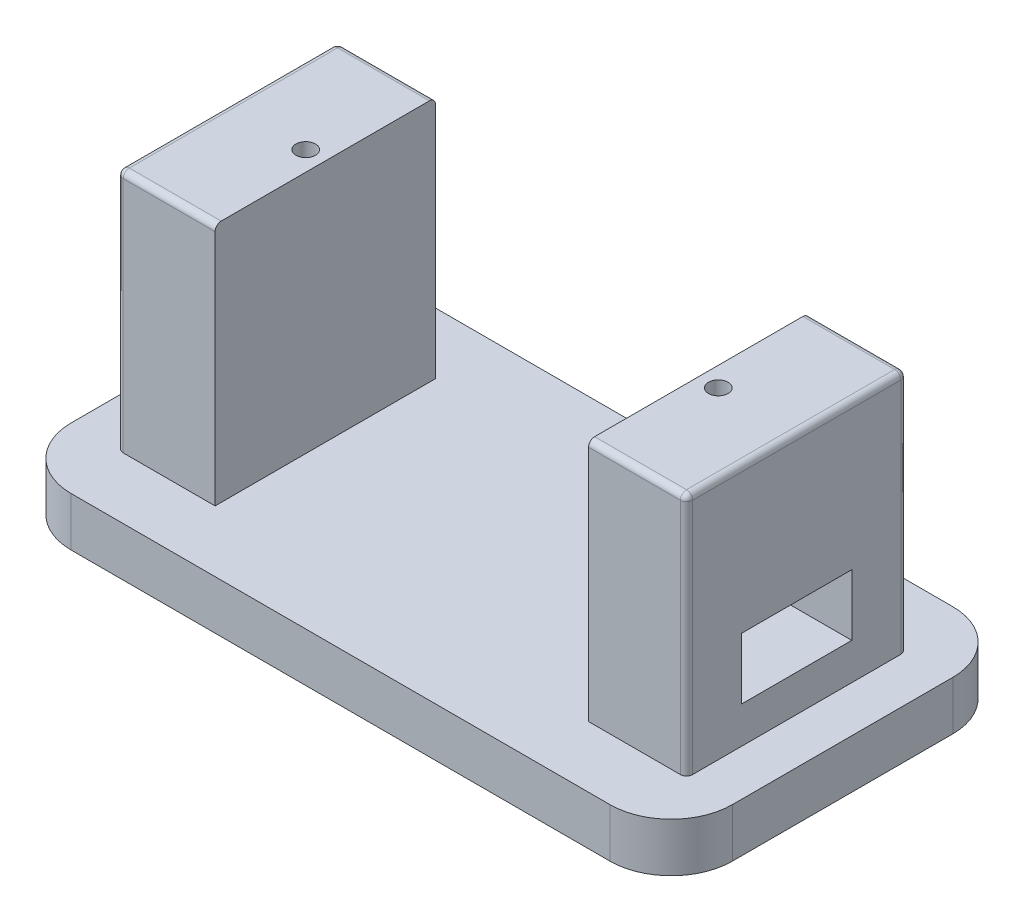
ISO-10303-21;
HEADER;
FILE_DESCRIPTION(('STEP AP214'),'2;1');
FILE_NAME('part.step','',(''),(''),'','','');
FILE_SCHEMA(('AUTOMOTIVE_DESIGN { 1 0 10303 214 1 1 1 1 }'));
ENDSEC;
DATA;
#1=APPLICATION_CONTEXT('core data for automotive mechanical design processes');
#2=APPLICATION_PROTOCOL_DEFINITION('international standard','automotive_design',2000,#1);
#3=PRODUCT_CONTEXT('',#1,'mechanical');
#4=PRODUCT('Part','Part','',(#3));
#5=PRODUCT_RELATED_PRODUCT_CATEGORY('part','',(#4));
#6=PRODUCT_DEFINITION_FORMATION('','',#4);
#7=PRODUCT_DEFINITION_CONTEXT('part definition',#1,'design');
#8=PRODUCT_DEFINITION('design','',#6,#7);
#9=PRODUCT_DEFINITION_SHAPE('','',#8);
#10=(LENGTH_UNIT() NAMED_UNIT(*) SI_UNIT(.MILLI.,.METRE.));
#11=(NAMED_UNIT(*) PLANE_ANGLE_UNIT() SI_UNIT($,.RADIAN.));
#12=(NAMED_UNIT(*) SI_UNIT($,.STERADIAN.) SOLID_ANGLE_UNIT());
#13=UNCERTAINTY_MEASURE_WITH_UNIT(LENGTH_MEASURE(1.E-05),#10,'distance_accuracy_value','');
#14=(GEOMETRIC_REPRESENTATION_CONTEXT(3) GLOBAL_UNCERTAINTY_ASSIGNED_CONTEXT((#13)) GLOBAL_UNIT_ASSIGNED_CONTEXT((#10,
#11,#12)) REPRESENTATION_CONTEXT('',''));
#15=CARTESIAN_POINT('',(0.,0.,0.));
#16=DIRECTION('',(0.,0.,1.));
#17=DIRECTION('',(1.,0.,0.));
#18=AXIS2_PLACEMENT_3D('',#15,#16,#17);
#19=CARTESIAN_POINT('',(0.,4.,0.));
#20=DIRECTION('',(0.,1.,0.));
#21=DIRECTION('',(0.,0.,1.));
#22=AXIS2_PLACEMENT_3D('',#19,#20,#21);
#23=PLANE('',#22);
#24=DIRECTION('',(0.,0.,-1.));
#25=VECTOR('',#24,1.);
#26=CARTESIAN_POINT('',(15.25,4.,-9.));
#27=LINE('',#26,#25);
#28=CARTESIAN_POINT('',(15.25,4.,9.));
#29=VERTEX_POINT('',#28);
#30=CARTESIAN_POINT('',(15.25,4.,-9.));
#31=VERTEX_POINT('',#30);
#32=EDGE_CURVE('E283',#29,#31,#27,.T.);
#33=ORIENTED_EDGE('',*,*,#32,.T.);
#34=DIRECTION('',(1.,0.,0.));
#35=VECTOR('',#34,1.);
#36=CARTESIAN_POINT('',(15.25,4.,-9.));
#37=LINE('',#36,#35);
#38=CARTESIAN_POINT('',(22.75,4.,-9.));
#39=VERTEX_POINT('',#38);
#40=EDGE_CURVE('E290',#31,#39,#37,.T.);
#41=ORIENTED_EDGE('',*,*,#40,.T.);
#42=CARTESIAN_POINT('',(22.75,4.,-8.49999999999999));
#43=DIRECTION('',(0.,1.,0.));
#44=DIRECTION('',(0.,0.,1.));
#45=AXIS2_PLACEMENT_3D('',#42,#43,#44);
#46=CIRCLE('',#45,0.5);
#47=CARTESIAN_POINT('',(23.25,4.,-8.49999999999999));
#48=VERTEX_POINT('',#47);
#49=EDGE_CURVE('E459',#39,#48,#46,.F.);
#50=ORIENTED_EDGE('',*,*,#49,.T.);
#51=DIRECTION('',(0.,0.,1.));
#52=VECTOR('',#51,1.);
#53=CARTESIAN_POINT('',(23.25,4.,-9.));
#54=LINE('',#53,#52);
#55=CARTESIAN_POINT('',(23.25,4.,8.49999999999999));
#56=VERTEX_POINT('',#55);
#57=EDGE_CURVE('E295',#48,#56,#54,.T.);
#58=ORIENTED_EDGE('',*,*,#57,.T.);
#59=CARTESIAN_POINT('',(22.75,4.,8.49999999999999));
#60=DIRECTION('',(0.,1.,0.));
#61=DIRECTION('',(0.,0.,1.));
#62=AXIS2_PLACEMENT_3D('',#59,#60,#61);
#63=CIRCLE('',#62,0.5);
#64=CARTESIAN_POINT('',(22.75,4.,9.));
#65=VERTEX_POINT('',#64);
#66=EDGE_CURVE('E457',#56,#65,#63,.F.);
#67=ORIENTED_EDGE('',*,*,#66,.T.);
#68=DIRECTION('',(-1.,0.,0.));
#69=VECTOR('',#68,1.);
#70=CARTESIAN_POINT('',(15.25,4.,9.));
#71=LINE('',#70,#69);
#72=EDGE_CURVE('E293',#65,#29,#71,.T.);
#73=ORIENTED_EDGE('',*,*,#72,.T.);
#74=EDGE_LOOP('',(#33,#41,#50,#58,#67,#73));
#75=FACE_BOUND('',#74,.T.);
#76=DIRECTION('',(1.,0.,0.));
#77=VECTOR('',#76,1.);
#78=CARTESIAN_POINT('',(-27.,4.,14.));
#79=LINE('',#78,#77);
#80=CARTESIAN_POINT('',(-22.,4.,14.));
#81=VERTEX_POINT('',#80);
#82=CARTESIAN_POINT('',(22.,4.,14.));
#83=VERTEX_POINT('',#82);
#84=EDGE_CURVE('E332',#81,#83,#79,.T.);
#85=ORIENTED_EDGE('',*,*,#84,.T.);
#86=CARTESIAN_POINT('',(22.,4.,9.));
#87=DIRECTION('',(0.,1.,0.));
#88=DIRECTION('',(0.,0.,1.));
#89=AXIS2_PLACEMENT_3D('',#86,#87,#88);
#90=CIRCLE('',#89,5.);
#91=CARTESIAN_POINT('',(27.,4.,9.));
#92=VERTEX_POINT('',#91);
#93=EDGE_CURVE('E369',#83,#92,#90,.T.);
#94=ORIENTED_EDGE('',*,*,#93,.T.);
#95=DIRECTION('',(0.,0.,-1.));
#96=VECTOR('',#95,1.);
#97=CARTESIAN_POINT('',(27.,4.,-14.));
#98=LINE('',#97,#96);
#99=CARTESIAN_POINT('',(27.,4.,-9.));
#100=VERTEX_POINT('',#99);
#101=EDGE_CURVE('E322',#92,#100,#98,.T.);
#102=ORIENTED_EDGE('',*,*,#101,.T.);
#103=CARTESIAN_POINT('',(22.,4.,-9.));
#104=DIRECTION('',(0.,1.,0.));
#105=DIRECTION('',(0.,0.,1.));
#106=AXIS2_PLACEMENT_3D('',#103,#104,#105);
#107=CIRCLE('',#106,5.);
#108=CARTESIAN_POINT('',(22.,4.,-14.));
#109=VERTEX_POINT('',#108);
#110=EDGE_CURVE('E367',#100,#109,#107,.T.);
#111=ORIENTED_EDGE('',*,*,#110,.T.);
#112=DIRECTION('',(-1.,0.,0.));
#113=VECTOR('',#112,1.);
#114=CARTESIAN_POINT('',(-27.,4.,-14.));
#115=LINE('',#114,#113);
#116=CARTESIAN_POINT('',(-22.,4.,-14.));
#117=VERTEX_POINT('',#116);
#118=EDGE_CURVE('E325',#109,#117,#115,.T.);
#119=ORIENTED_EDGE('',*,*,#118,.T.);
#120=CARTESIAN_POINT('',(-22.,4.,-9.));
#121=DIRECTION('',(0.,1.,0.));
#122=DIRECTION('',(0.,0.,1.));
#123=AXIS2_PLACEMENT_3D('',#120,#121,#122);
#124=CIRCLE('',#123,5.);
#125=CARTESIAN_POINT('',(-27.,4.,-9.));
#126=VERTEX_POINT('',#125);
#127=EDGE_CURVE('E365',#117,#126,#124,.T.);
#128=ORIENTED_EDGE('',*,*,#127,.T.);
#129=DIRECTION('',(0.,0.,1.));
#130=VECTOR('',#129,1.);
#131=CARTESIAN_POINT('',(-27.,4.,-14.));
#132=LINE('',#131,#130);
#133=CARTESIAN_POINT('',(-27.,4.,9.));
#134=VERTEX_POINT('',#133);
#135=EDGE_CURVE('E329',#126,#134,#132,.T.);
#136=ORIENTED_EDGE('',*,*,#135,.T.);
#137=CARTESIAN_POINT('',(-22.,4.,9.));
#138=DIRECTION('',(0.,1.,0.));
#139=DIRECTION('',(0.,0.,1.));
#140=AXIS2_PLACEMENT_3D('',#137,#138,#139);
#141=CIRCLE('',#140,5.);
#142=EDGE_CURVE('E363',#134,#81,#141,.T.);
#143=ORIENTED_EDGE('',*,*,#142,.T.);
#144=EDGE_LOOP('',(#85,#94,#102,#111,#119,#128,#136,#143));
#145=FACE_BOUND('',#144,.T.);
#146=DIRECTION('',(-1.,0.,0.));
#147=VECTOR('',#146,1.);
#148=CARTESIAN_POINT('',(-15.25,4.,-9.));
#149=LINE('',#148,#147);
#150=CARTESIAN_POINT('',(-15.25,4.,-9.));
#151=VERTEX_POINT('',#150);
#152=CARTESIAN_POINT('',(-22.75,4.,-9.));
#153=VERTEX_POINT('',#152);
#154=EDGE_CURVE('E312',#151,#153,#149,.T.);
#155=ORIENTED_EDGE('',*,*,#154,.F.);
#156=DIRECTION('',(0.,0.,-1.));
#157=VECTOR('',#156,1.);
#158=CARTESIAN_POINT('',(-15.25,4.,-9.));
#159=LINE('',#158,#157);
#160=CARTESIAN_POINT('',(-15.25,4.,9.));
#161=VERTEX_POINT('',#160);
#162=EDGE_CURVE('E304',#161,#151,#159,.T.);
#163=ORIENTED_EDGE('',*,*,#162,.F.);
#164=DIRECTION('',(1.,0.,0.));
#165=VECTOR('',#164,1.);
#166=CARTESIAN_POINT('',(-15.25,4.,9.));
#167=LINE('',#166,#165);
#168=CARTESIAN_POINT('',(-22.75,4.,9.));
#169=VERTEX_POINT('',#168);
#170=EDGE_CURVE('E309',#169,#161,#167,.T.);
#171=ORIENTED_EDGE('',*,*,#170,.F.);
#172=CARTESIAN_POINT('',(-22.75,4.,8.5));
#173=DIRECTION('',(0.,1.,0.));
#174=DIRECTION('',(0.,0.,1.));
#175=AXIS2_PLACEMENT_3D('',#172,#173,#174);
#176=CIRCLE('',#175,0.5);
#177=CARTESIAN_POINT('',(-23.25,4.,8.5));
#178=VERTEX_POINT('',#177);
#179=EDGE_CURVE('E54',#169,#178,#176,.F.);
#180=ORIENTED_EDGE('',*,*,#179,.T.);
#181=DIRECTION('',(0.,0.,1.));
#182=VECTOR('',#181,1.);
#183=CARTESIAN_POINT('',(-23.25,4.,-9.));
#184=LINE('',#183,#182);
#185=CARTESIAN_POINT('',(-23.25,4.,-8.49999999999999));
#186=VERTEX_POINT('',#185);
#187=EDGE_CURVE('E314',#186,#178,#184,.T.);
#188=ORIENTED_EDGE('',*,*,#187,.F.);
#189=CARTESIAN_POINT('',(-22.75,4.,-8.49999999999999));
#190=DIRECTION('',(0.,1.,0.));
#191=DIRECTION('',(0.,0.,1.));
#192=AXIS2_PLACEMENT_3D('',#189,#190,#191);
#193=CIRCLE('',#192,0.5);
#194=EDGE_CURVE('E11',#186,#153,#193,.F.);
#195=ORIENTED_EDGE('',*,*,#194,.T.);
#196=EDGE_LOOP('',(#155,#163,#171,#180,#188,#195));
#197=FACE_BOUND('',#196,.T.);
#198=ADVANCED_FACE('F45',(#75,#145,#197),#23,.T.);
#199=CARTESIAN_POINT('',(27.,4.,-14.));
#200=DIRECTION('',(-1.,0.,0.));
#201=DIRECTION('',(0.,0.,1.));
#202=AXIS2_PLACEMENT_3D('',#199,#200,#201);
#203=PLANE('',#202);
#204=ORIENTED_EDGE('',*,*,#101,.F.);
#205=DIRECTION('',(0.,-1.,0.));
#206=VECTOR('',#205,1.);
#207=CARTESIAN_POINT('',(27.,4.,9.));
#208=LINE('',#207,#206);
#209=CARTESIAN_POINT('',(27.,0.,9.));
#210=VERTEX_POINT('',#209);
#211=EDGE_CURVE('E347',#92,#210,#208,.T.);
#212=ORIENTED_EDGE('',*,*,#211,.T.);
#213=DIRECTION('',(0.,0.,-1.));
#214=VECTOR('',#213,1.);
#215=CARTESIAN_POINT('',(27.,0.,-14.));
#216=LINE('',#215,#214);
#217=CARTESIAN_POINT('',(27.,0.,-9.));
#218=VERTEX_POINT('',#217);
#219=EDGE_CURVE('E321',#210,#218,#216,.T.);
#220=ORIENTED_EDGE('',*,*,#219,.T.);
#221=DIRECTION('',(0.,-1.,0.));
#222=VECTOR('',#221,1.);
#223=CARTESIAN_POINT('',(27.,4.,-9.));
#224=LINE('',#223,#222);
#225=EDGE_CURVE('E335',#218,#100,#224,.F.);
#226=ORIENTED_EDGE('',*,*,#225,.T.);
#227=EDGE_LOOP('',(#204,#212,#220,#226));
#228=FACE_BOUND('',#227,.T.);
#229=ADVANCED_FACE('F486',(#228),#203,.F.);
#230=CARTESIAN_POINT('',(-27.,4.,-14.));
#231=DIRECTION('',(0.,0.,1.));
#232=DIRECTION('',(1.,0.,0.));
#233=AXIS2_PLACEMENT_3D('',#230,#231,#232);
#234=PLANE('',#233);
#235=ORIENTED_EDGE('',*,*,#118,.F.);
#236=DIRECTION('',(0.,-1.,0.));
#237=VECTOR('',#236,1.);
#238=CARTESIAN_POINT('',(22.,4.,-14.));
#239=LINE('',#238,#237);
#240=CARTESIAN_POINT('',(22.,0.,-14.));
#241=VERTEX_POINT('',#240);
#242=EDGE_CURVE('E373',#109,#241,#239,.T.);
#243=ORIENTED_EDGE('',*,*,#242,.T.);
#244=DIRECTION('',(-1.,0.,0.));
#245=VECTOR('',#244,1.);
#246=CARTESIAN_POINT('',(-27.,0.,-14.));
#247=LINE('',#246,#245);
#248=CARTESIAN_POINT('',(-22.,0.,-14.));
#249=VERTEX_POINT('',#248);
#250=EDGE_CURVE('E338',#241,#249,#247,.T.);
#251=ORIENTED_EDGE('',*,*,#250,.T.);
#252=DIRECTION('',(0.,-1.,0.));
#253=VECTOR('',#252,1.);
#254=CARTESIAN_POINT('',(-22.,4.,-14.));
#255=LINE('',#254,#253);
#256=EDGE_CURVE('E371',#249,#117,#255,.F.);
#257=ORIENTED_EDGE('',*,*,#256,.T.);
#258=EDGE_LOOP('',(#235,#243,#251,#257));
#259=FACE_BOUND('',#258,.T.);
#260=ADVANCED_FACE('F494',(#259),#234,.F.);
#261=CARTESIAN_POINT('',(-27.,4.,-14.));
#262=DIRECTION('',(1.,0.,0.));
#263=DIRECTION('',(0.,0.,-1.));
#264=AXIS2_PLACEMENT_3D('',#261,#262,#263);
#265=PLANE('',#264);
#266=ORIENTED_EDGE('',*,*,#135,.F.);
#267=DIRECTION('',(0.,-1.,0.));
#268=VECTOR('',#267,1.);
#269=CARTESIAN_POINT('',(-27.,4.,-9.));
#270=LINE('',#269,#268);
#271=CARTESIAN_POINT('',(-27.,0.,-9.));
#272=VERTEX_POINT('',#271);
#273=EDGE_CURVE('E378',#126,#272,#270,.T.);
#274=ORIENTED_EDGE('',*,*,#273,.T.);
#275=DIRECTION('',(0.,0.,1.));
#276=VECTOR('',#275,1.);
#277=CARTESIAN_POINT('',(-27.,0.,-14.));
#278=LINE('',#277,#276);
#279=CARTESIAN_POINT('',(-27.,0.,9.));
#280=VERTEX_POINT('',#279);
#281=EDGE_CURVE('E341',#272,#280,#278,.T.);
#282=ORIENTED_EDGE('',*,*,#281,.T.);
#283=DIRECTION('',(0.,-1.,0.));
#284=VECTOR('',#283,1.);
#285=CARTESIAN_POINT('',(-27.,4.,9.));
#286=LINE('',#285,#284);
#287=EDGE_CURVE('E376',#280,#134,#286,.F.);
#288=ORIENTED_EDGE('',*,*,#287,.T.);
#289=EDGE_LOOP('',(#266,#274,#282,#288));
#290=FACE_BOUND('',#289,.T.);
#291=ADVANCED_FACE('F509',(#290),#265,.F.);
#292=CARTESIAN_POINT('',(-27.,4.,14.));
#293=DIRECTION('',(0.,0.,-1.));
#294=DIRECTION('',(-1.,0.,0.));
#295=AXIS2_PLACEMENT_3D('',#292,#293,#294);
#296=PLANE('',#295);
#297=DIRECTION('',(1.,0.,0.));
#298=VECTOR('',#297,1.);
#299=CARTESIAN_POINT('',(-27.,0.,14.));
#300=LINE('',#299,#298);
#301=CARTESIAN_POINT('',(-22.,0.,14.));
#302=VERTEX_POINT('',#301);
#303=CARTESIAN_POINT('',(22.,0.,14.));
#304=VERTEX_POINT('',#303);
#305=EDGE_CURVE('E326',#302,#304,#300,.T.);
#306=ORIENTED_EDGE('',*,*,#305,.T.);
#307=DIRECTION('',(0.,-1.,0.));
#308=VECTOR('',#307,1.);
#309=CARTESIAN_POINT('',(22.,4.,14.));
#310=LINE('',#309,#308);
#311=EDGE_CURVE('E361',#304,#83,#310,.F.);
#312=ORIENTED_EDGE('',*,*,#311,.T.);
#313=ORIENTED_EDGE('',*,*,#84,.F.);
#314=DIRECTION('',(0.,-1.,0.));
#315=VECTOR('',#314,1.);
#316=CARTESIAN_POINT('',(-22.,4.,14.));
#317=LINE('',#316,#315);
#318=EDGE_CURVE('E358',#81,#302,#317,.T.);
#319=ORIENTED_EDGE('',*,*,#318,.T.);
#320=EDGE_LOOP('',(#306,#312,#313,#319));
#321=FACE_BOUND('',#320,.T.);
#322=ADVANCED_FACE('F505',(#321),#296,.F.);
#323=CARTESIAN_POINT('',(0.,0.,0.));
#324=DIRECTION('',(0.,1.,0.));
#325=DIRECTION('',(0.,0.,1.));
#326=AXIS2_PLACEMENT_3D('',#323,#324,#325);
#327=PLANE('',#326);
#328=ORIENTED_EDGE('',*,*,#219,.F.);
#329=CARTESIAN_POINT('',(22.,0.,9.));
#330=DIRECTION('',(0.,1.,0.));
#331=DIRECTION('',(0.,0.,1.));
#332=AXIS2_PLACEMENT_3D('',#329,#330,#331);
#333=CIRCLE('',#332,5.);
#334=EDGE_CURVE('E356',#210,#304,#333,.F.);
#335=ORIENTED_EDGE('',*,*,#334,.T.);
#336=ORIENTED_EDGE('',*,*,#305,.F.);
#337=CARTESIAN_POINT('',(-22.,0.,9.));
#338=DIRECTION('',(0.,1.,0.));
#339=DIRECTION('',(0.,0.,1.));
#340=AXIS2_PLACEMENT_3D('',#337,#338,#339);
#341=CIRCLE('',#340,5.);
#342=EDGE_CURVE('E350',#302,#280,#341,.F.);
#343=ORIENTED_EDGE('',*,*,#342,.T.);
#344=ORIENTED_EDGE('',*,*,#281,.F.);
#345=CARTESIAN_POINT('',(-22.,0.,-9.));
#346=DIRECTION('',(0.,1.,0.));
#347=DIRECTION('',(0.,0.,1.));
#348=AXIS2_PLACEMENT_3D('',#345,#346,#347);
#349=CIRCLE('',#348,5.);
#350=EDGE_CURVE('E352',#272,#249,#349,.F.);
#351=ORIENTED_EDGE('',*,*,#350,.T.);
#352=ORIENTED_EDGE('',*,*,#250,.F.);
#353=CARTESIAN_POINT('',(22.,0.,-9.));
#354=DIRECTION('',(0.,1.,0.));
#355=DIRECTION('',(0.,0.,1.));
#356=AXIS2_PLACEMENT_3D('',#353,#354,#355);
#357=CIRCLE('',#356,5.);
#358=EDGE_CURVE('E354',#241,#218,#357,.F.);
#359=ORIENTED_EDGE('',*,*,#358,.T.);
#360=EDGE_LOOP('',(#328,#335,#336,#343,#344,#351,#352,#359));
#361=FACE_BOUND('',#360,.T.);
#362=ADVANCED_FACE('F502',(#361),#327,.F.);
#363=CARTESIAN_POINT('',(-15.25,23.9,-9.));
#364=DIRECTION('',(-1.,0.,0.));
#365=DIRECTION('',(0.,0.,1.));
#366=AXIS2_PLACEMENT_3D('',#363,#364,#365);
#367=PLANE('',#366);
#368=DIRECTION('',(0.,-1.,0.));
#369=VECTOR('',#368,1.);
#370=CARTESIAN_POINT('',(-15.25,23.9,-9.));
#371=LINE('',#370,#369);
#372=CARTESIAN_POINT('',(-15.25,23.4,-9.));
#373=VERTEX_POINT('',#372);
#374=EDGE_CURVE('E319',#373,#151,#371,.T.);
#375=ORIENTED_EDGE('',*,*,#374,.F.);
#376=CARTESIAN_POINT('',(-15.25,23.4,-8.5));
#377=DIRECTION('',(-1.,0.,0.));
#378=DIRECTION('',(0.,0.,1.));
#379=AXIS2_PLACEMENT_3D('',#376,#377,#378);
#380=CIRCLE('',#379,0.5);
#381=CARTESIAN_POINT('',(-15.25,23.9,-8.5));
#382=VERTEX_POINT('',#381);
#383=EDGE_CURVE('E393',#373,#382,#380,.F.);
#384=ORIENTED_EDGE('',*,*,#383,.T.);
#385=DIRECTION('',(0.,0.,-1.));
#386=VECTOR('',#385,1.);
#387=CARTESIAN_POINT('',(-15.25,23.9,-9.));
#388=LINE('',#387,#386);
#389=CARTESIAN_POINT('',(-15.25,23.9,8.5));
#390=VERTEX_POINT('',#389);
#391=EDGE_CURVE('E305',#390,#382,#388,.T.);
#392=ORIENTED_EDGE('',*,*,#391,.F.);
#393=CARTESIAN_POINT('',(-15.25,23.4,8.5));
#394=DIRECTION('',(-1.,0.,0.));
#395=DIRECTION('',(0.,0.,1.));
#396=AXIS2_PLACEMENT_3D('',#393,#394,#395);
#397=CIRCLE('',#396,0.5);
#398=CARTESIAN_POINT('',(-15.25,23.4,9.));
#399=VERTEX_POINT('',#398);
#400=EDGE_CURVE('E391',#390,#399,#397,.F.);
#401=ORIENTED_EDGE('',*,*,#400,.T.);
#402=DIRECTION('',(0.,-1.,0.));
#403=VECTOR('',#402,1.);
#404=CARTESIAN_POINT('',(-15.25,23.9,9.));
#405=LINE('',#404,#403);
#406=EDGE_CURVE('E308',#399,#161,#405,.T.);
#407=ORIENTED_EDGE('',*,*,#406,.T.);
#408=ORIENTED_EDGE('',*,*,#162,.T.);
#409=EDGE_LOOP('',(#375,#384,#392,#401,#407,#408));
#410=FACE_BOUND('',#409,.T.);
#411=ADVANCED_FACE('F500',(#410),#367,.F.);
#412=CARTESIAN_POINT('',(-15.25,23.9,-9.));
#413=DIRECTION('',(0.,0.,1.));
#414=DIRECTION('',(1.,0.,0.));
#415=AXIS2_PLACEMENT_3D('',#412,#413,#414);
#416=PLANE('',#415);
#417=ORIENTED_EDGE('',*,*,#154,.T.);
#418=DIRECTION('',(0.,-1.,0.));
#419=VECTOR('',#418,1.);
#420=CARTESIAN_POINT('',(-22.75,23.9,-9.));
#421=LINE('',#420,#419);
#422=CARTESIAN_POINT('',(-22.75,23.4,-9.));
#423=VERTEX_POINT('',#422);
#424=EDGE_CURVE('E455',#153,#423,#421,.F.);
#425=ORIENTED_EDGE('',*,*,#424,.T.);
#426=DIRECTION('',(-1.,0.,0.));
#427=VECTOR('',#426,1.);
#428=CARTESIAN_POINT('',(-15.25,23.4,-9.));
#429=LINE('',#428,#427);
#430=EDGE_CURVE('E389',#423,#373,#429,.F.);
#431=ORIENTED_EDGE('',*,*,#430,.T.);
#432=ORIENTED_EDGE('',*,*,#374,.T.);
#433=EDGE_LOOP('',(#417,#425,#431,#432));
#434=FACE_BOUND('',#433,.T.);
#435=ADVANCED_FACE('F708',(#434),#416,.F.);
#436=CARTESIAN_POINT('',(-23.25,23.9,-9.));
#437=DIRECTION('',(1.,0.,0.));
#438=DIRECTION('',(0.,0.,-1.));
#439=AXIS2_PLACEMENT_3D('',#436,#437,#438);
#440=PLANE('',#439);
#441=ORIENTED_EDGE('',*,*,#187,.T.);
#442=DIRECTION('',(0.,-1.,0.));
#443=VECTOR('',#442,1.);
#444=CARTESIAN_POINT('',(-23.25,23.9,8.5));
#445=LINE('',#444,#443);
#446=CARTESIAN_POINT('',(-23.25,23.4,8.5));
#447=VERTEX_POINT('',#446);
#448=EDGE_CURVE('E453',#178,#447,#445,.F.);
#449=ORIENTED_EDGE('',*,*,#448,.T.);
#450=DIRECTION('',(0.,0.,1.));
#451=VECTOR('',#450,1.);
#452=CARTESIAN_POINT('',(-23.25,23.4,-9.));
#453=LINE('',#452,#451);
#454=CARTESIAN_POINT('',(-23.25,23.4,-8.49999999999999));
#455=VERTEX_POINT('',#454);
#456=EDGE_CURVE('E395',#447,#455,#453,.F.);
#457=ORIENTED_EDGE('',*,*,#456,.T.);
#458=DIRECTION('',(0.,-1.,0.));
#459=VECTOR('',#458,1.);
#460=CARTESIAN_POINT('',(-23.25,23.9,-8.49999999999999));
#461=LINE('',#460,#459);
#462=EDGE_CURVE('E451',#455,#186,#461,.T.);
#463=ORIENTED_EDGE('',*,*,#462,.T.);
#464=EDGE_LOOP('',(#441,#449,#457,#463));
#465=FACE_BOUND('',#464,.T.);
#466=ADVANCED_FACE('F481',(#465),#440,.F.);
#467=CARTESIAN_POINT('',(-15.25,23.9,9.));
#468=DIRECTION('',(0.,0.,-1.));
#469=DIRECTION('',(-1.,0.,0.));
#470=AXIS2_PLACEMENT_3D('',#467,#468,#469);
#471=PLANE('',#470);
#472=DIRECTION('',(1.,0.,0.));
#473=VECTOR('',#472,1.);
#474=CARTESIAN_POINT('',(-15.25,23.4,9.));
#475=LINE('',#474,#473);
#476=CARTESIAN_POINT('',(-22.75,23.4,9.));
#477=VERTEX_POINT('',#476);
#478=EDGE_CURVE('E398',#399,#477,#475,.F.);
#479=ORIENTED_EDGE('',*,*,#478,.T.);
#480=DIRECTION('',(0.,-1.,0.));
#481=VECTOR('',#480,1.);
#482=CARTESIAN_POINT('',(-22.75,23.9,9.));
#483=LINE('',#482,#481);
#484=EDGE_CURVE('E449',#477,#169,#483,.T.);
#485=ORIENTED_EDGE('',*,*,#484,.T.);
#486=ORIENTED_EDGE('',*,*,#170,.T.);
#487=ORIENTED_EDGE('',*,*,#406,.F.);
#488=EDGE_LOOP('',(#479,#485,#486,#487));
#489=FACE_BOUND('',#488,.T.);
#490=ADVANCED_FACE('F692',(#489),#471,.F.);
#491=CARTESIAN_POINT('',(0.,23.9,0.));
#492=DIRECTION('',(0.,-1.,0.));
#493=DIRECTION('',(0.,0.,-1.));
#494=AXIS2_PLACEMENT_3D('',#491,#492,#493);
#495=PLANE('',#494);
#496=CARTESIAN_POINT('',(-16.85,23.9,0.));
#497=DIRECTION('',(0.,1.,0.));
#498=DIRECTION('',(0.,0.,1.));
#499=AXIS2_PLACEMENT_3D('',#496,#497,#498);
#500=CIRCLE('',#499,0.799999999999999);
#501=CARTESIAN_POINT('',(-16.85,23.9,0.799999999999996));
#502=VERTEX_POINT('',#501);
#503=EDGE_CURVE('E277',#502,#502,#500,.T.);
#504=ORIENTED_EDGE('',*,*,#503,.F.);
#505=EDGE_LOOP('',(#504));
#506=FACE_BOUND('',#505,.T.);
#507=ORIENTED_EDGE('',*,*,#391,.T.);
#508=DIRECTION('',(-1.,0.,0.));
#509=VECTOR('',#508,1.);
#510=CARTESIAN_POINT('',(0.,23.9,-8.5));
#511=LINE('',#510,#509);
#512=CARTESIAN_POINT('',(-22.75,23.9,-8.49999999999999));
#513=VERTEX_POINT('',#512);
#514=EDGE_CURVE('E386',#382,#513,#511,.T.);
#515=ORIENTED_EDGE('',*,*,#514,.T.);
#516=DIRECTION('',(0.,0.,1.));
#517=VECTOR('',#516,1.);
#518=CARTESIAN_POINT('',(-22.75,23.9,0.));
#519=LINE('',#518,#517);
#520=CARTESIAN_POINT('',(-22.75,23.9,8.5));
#521=VERTEX_POINT('',#520);
#522=EDGE_CURVE('E383',#513,#521,#519,.T.);
#523=ORIENTED_EDGE('',*,*,#522,.T.);
#524=DIRECTION('',(1.,0.,0.));
#525=VECTOR('',#524,1.);
#526=CARTESIAN_POINT('',(0.,23.9,8.5));
#527=LINE('',#526,#525);
#528=EDGE_CURVE('E381',#521,#390,#527,.T.);
#529=ORIENTED_EDGE('',*,*,#528,.T.);
#530=EDGE_LOOP('',(#507,#515,#523,#529));
#531=FACE_BOUND('',#530,.T.);
#532=ADVANCED_FACE('F688',(#506,#531),#495,.F.);
#533=CARTESIAN_POINT('',(15.25,23.9,-9.));
#534=DIRECTION('',(-1.,0.,0.));
#535=DIRECTION('',(0.,0.,1.));
#536=AXIS2_PLACEMENT_3D('',#533,#534,#535);
#537=PLANE('',#536);
#538=DIRECTION('',(0.,-1.,0.));
#539=VECTOR('',#538,1.);
#540=CARTESIAN_POINT('',(15.25,23.9,-4.5));
#541=LINE('',#540,#539);
#542=CARTESIAN_POINT('',(15.25,11.9922091630726,-4.5));
#543=VERTEX_POINT('',#542);
#544=CARTESIAN_POINT('',(15.25,6.99220916307264,-4.5));
#545=VERTEX_POINT('',#544);
#546=EDGE_CURVE('E271',#543,#545,#541,.T.);
#547=ORIENTED_EDGE('',*,*,#546,.F.);
#548=DIRECTION('',(0.,0.,-1.));
#549=VECTOR('',#548,1.);
#550=CARTESIAN_POINT('',(15.25,11.9922091630726,-9.));
#551=LINE('',#550,#549);
#552=CARTESIAN_POINT('',(15.25,11.9922091630726,4.5));
#553=VERTEX_POINT('',#552);
#554=EDGE_CURVE('E264',#553,#543,#551,.T.);
#555=ORIENTED_EDGE('',*,*,#554,.F.);
#556=DIRECTION('',(0.,1.,0.));
#557=VECTOR('',#556,1.);
#558=CARTESIAN_POINT('',(15.25,23.9,4.5));
#559=LINE('',#558,#557);
#560=CARTESIAN_POINT('',(15.25,6.99220916307264,4.5));
#561=VERTEX_POINT('',#560);
#562=EDGE_CURVE('E239',#561,#553,#559,.T.);
#563=ORIENTED_EDGE('',*,*,#562,.F.);
#564=DIRECTION('',(0.,0.,1.));
#565=VECTOR('',#564,1.);
#566=CARTESIAN_POINT('',(15.25,6.99220916307264,-9.));
#567=LINE('',#566,#565);
#568=EDGE_CURVE('E269',#545,#561,#567,.T.);
#569=ORIENTED_EDGE('',*,*,#568,.F.);
#570=EDGE_LOOP('',(#547,#555,#563,#569));
#571=FACE_BOUND('',#570,.T.);
#572=DIRECTION('',(0.,-1.,0.));
#573=VECTOR('',#572,1.);
#574=CARTESIAN_POINT('',(15.25,23.9,9.));
#575=LINE('',#574,#573);
#576=CARTESIAN_POINT('',(15.25,23.4,9.));
#577=VERTEX_POINT('',#576);
#578=EDGE_CURVE('E301',#577,#29,#575,.T.);
#579=ORIENTED_EDGE('',*,*,#578,.F.);
#580=CARTESIAN_POINT('',(15.25,23.4,8.5));
#581=DIRECTION('',(-1.,0.,0.));
#582=DIRECTION('',(0.,0.,1.));
#583=AXIS2_PLACEMENT_3D('',#580,#581,#582);
#584=CIRCLE('',#583,0.5);
#585=CARTESIAN_POINT('',(15.25,23.9,8.5));
#586=VERTEX_POINT('',#585);
#587=EDGE_CURVE('E405',#577,#586,#584,.T.);
#588=ORIENTED_EDGE('',*,*,#587,.T.);
#589=DIRECTION('',(0.,0.,-1.));
#590=VECTOR('',#589,1.);
#591=CARTESIAN_POINT('',(15.25,23.9,-9.));
#592=LINE('',#591,#590);
#593=CARTESIAN_POINT('',(15.25,23.9,-8.5));
#594=VERTEX_POINT('',#593);
#595=EDGE_CURVE('E286',#586,#594,#592,.T.);
#596=ORIENTED_EDGE('',*,*,#595,.T.);
#597=CARTESIAN_POINT('',(15.25,23.4,-8.5));
#598=DIRECTION('',(-1.,0.,0.));
#599=DIRECTION('',(0.,0.,1.));
#600=AXIS2_PLACEMENT_3D('',#597,#598,#599);
#601=CIRCLE('',#600,0.5);
#602=CARTESIAN_POINT('',(15.25,23.4,-9.));
#603=VERTEX_POINT('',#602);
#604=EDGE_CURVE('E403',#594,#603,#601,.T.);
#605=ORIENTED_EDGE('',*,*,#604,.T.);
#606=DIRECTION('',(0.,-1.,0.));
#607=VECTOR('',#606,1.);
#608=CARTESIAN_POINT('',(15.25,23.9,-9.));
#609=LINE('',#608,#607);
#610=EDGE_CURVE('E289',#603,#31,#609,.T.);
#611=ORIENTED_EDGE('',*,*,#610,.T.);
#612=ORIENTED_EDGE('',*,*,#32,.F.);
#613=EDGE_LOOP('',(#579,#588,#596,#605,#611,#612));
#614=FACE_BOUND('',#613,.T.);
#615=ADVANCED_FACE('F681',(#571,#614),#537,.T.);
#616=CARTESIAN_POINT('',(15.25,23.9,9.));
#617=DIRECTION('',(0.,0.,1.));
#618=DIRECTION('',(1.,0.,0.));
#619=AXIS2_PLACEMENT_3D('',#616,#617,#618);
#620=PLANE('',#619);
#621=ORIENTED_EDGE('',*,*,#72,.F.);
#622=DIRECTION('',(0.,-1.,0.));
#623=VECTOR('',#622,1.);
#624=CARTESIAN_POINT('',(22.75,23.9,9.));
#625=LINE('',#624,#623);
#626=CARTESIAN_POINT('',(22.75,23.4,9.));
#627=VERTEX_POINT('',#626);
#628=EDGE_CURVE('E445',#65,#627,#625,.F.);
#629=ORIENTED_EDGE('',*,*,#628,.T.);
#630=DIRECTION('',(-1.,0.,0.));
#631=VECTOR('',#630,1.);
#632=CARTESIAN_POINT('',(15.25,23.4,9.));
#633=LINE('',#632,#631);
#634=EDGE_CURVE('E401',#627,#577,#633,.T.);
#635=ORIENTED_EDGE('',*,*,#634,.T.);
#636=ORIENTED_EDGE('',*,*,#578,.T.);
#637=EDGE_LOOP('',(#621,#629,#635,#636));
#638=FACE_BOUND('',#637,.T.);
#639=ADVANCED_FACE('F673',(#638),#620,.T.);
#640=CARTESIAN_POINT('',(23.25,23.9,-9.));
#641=DIRECTION('',(1.,0.,0.));
#642=DIRECTION('',(0.,0.,-1.));
#643=AXIS2_PLACEMENT_3D('',#640,#641,#642);
#644=PLANE('',#643);
#645=DIRECTION('',(0.,1.,0.));
#646=VECTOR('',#645,1.);
#647=CARTESIAN_POINT('',(23.25,11.9922091630726,-4.5));
#648=LINE('',#647,#646);
#649=CARTESIAN_POINT('',(23.25,6.99220916307264,-4.5));
#650=VERTEX_POINT('',#649);
#651=CARTESIAN_POINT('',(23.25,11.9922091630726,-4.5));
#652=VERTEX_POINT('',#651);
#653=EDGE_CURVE('E252',#650,#652,#648,.T.);
#654=ORIENTED_EDGE('',*,*,#653,.F.);
#655=DIRECTION('',(0.,0.,-1.));
#656=VECTOR('',#655,1.);
#657=CARTESIAN_POINT('',(23.25,6.99220916307264,4.5));
#658=LINE('',#657,#656);
#659=CARTESIAN_POINT('',(23.25,6.99220916307264,4.5));
#660=VERTEX_POINT('',#659);
#661=EDGE_CURVE('E257',#660,#650,#658,.T.);
#662=ORIENTED_EDGE('',*,*,#661,.F.);
#663=DIRECTION('',(0.,-1.,0.));
#664=VECTOR('',#663,1.);
#665=CARTESIAN_POINT('',(23.25,11.9922091630726,4.5));
#666=LINE('',#665,#664);
#667=CARTESIAN_POINT('',(23.25,11.9922091630726,4.5));
#668=VERTEX_POINT('',#667);
#669=EDGE_CURVE('E236',#668,#660,#666,.T.);
#670=ORIENTED_EDGE('',*,*,#669,.F.);
#671=DIRECTION('',(0.,0.,1.));
#672=VECTOR('',#671,1.);
#673=CARTESIAN_POINT('',(23.25,11.9922091630726,4.5));
#674=LINE('',#673,#672);
#675=EDGE_CURVE('E247',#652,#668,#674,.T.);
#676=ORIENTED_EDGE('',*,*,#675,.F.);
#677=EDGE_LOOP('',(#654,#662,#670,#676));
#678=FACE_BOUND('',#677,.T.);
#679=DIRECTION('',(0.,0.,1.));
#680=VECTOR('',#679,1.);
#681=CARTESIAN_POINT('',(23.25,23.4,9.));
#682=LINE('',#681,#680);
#683=CARTESIAN_POINT('',(23.25,23.4,-8.49999999999999));
#684=VERTEX_POINT('',#683);
#685=CARTESIAN_POINT('',(23.25,23.4,8.49999999999999));
#686=VERTEX_POINT('',#685);
#687=EDGE_CURVE('E415',#684,#686,#682,.T.);
#688=ORIENTED_EDGE('',*,*,#687,.T.);
#689=DIRECTION('',(0.,-1.,0.));
#690=VECTOR('',#689,1.);
#691=CARTESIAN_POINT('',(23.25,23.9,8.49999999999999));
#692=LINE('',#691,#690);
#693=EDGE_CURVE('E443',#686,#56,#692,.T.);
#694=ORIENTED_EDGE('',*,*,#693,.T.);
#695=ORIENTED_EDGE('',*,*,#57,.F.);
#696=DIRECTION('',(0.,-1.,0.));
#697=VECTOR('',#696,1.);
#698=CARTESIAN_POINT('',(23.25,23.9,-8.49999999999999));
#699=LINE('',#698,#697);
#700=EDGE_CURVE('E441',#48,#684,#699,.F.);
#701=ORIENTED_EDGE('',*,*,#700,.T.);
#702=EDGE_LOOP('',(#688,#694,#695,#701));
#703=FACE_BOUND('',#702,.T.);
#704=ADVANCED_FACE('F254',(#678,#703),#644,.T.);
#705=CARTESIAN_POINT('',(15.25,23.9,-9.));
#706=DIRECTION('',(0.,0.,-1.));
#707=DIRECTION('',(-1.,0.,0.));
#708=AXIS2_PLACEMENT_3D('',#705,#706,#707);
#709=PLANE('',#708);
#710=DIRECTION('',(1.,0.,0.));
#711=VECTOR('',#710,1.);
#712=CARTESIAN_POINT('',(23.25,23.4,-9.));
#713=LINE('',#712,#711);
#714=CARTESIAN_POINT('',(22.75,23.4,-9.));
#715=VERTEX_POINT('',#714);
#716=EDGE_CURVE('E418',#603,#715,#713,.T.);
#717=ORIENTED_EDGE('',*,*,#716,.T.);
#718=DIRECTION('',(0.,-1.,0.));
#719=VECTOR('',#718,1.);
#720=CARTESIAN_POINT('',(22.75,23.9,-9.));
#721=LINE('',#720,#719);
#722=EDGE_CURVE('E447',#715,#39,#721,.T.);
#723=ORIENTED_EDGE('',*,*,#722,.T.);
#724=ORIENTED_EDGE('',*,*,#40,.F.);
#725=ORIENTED_EDGE('',*,*,#610,.F.);
#726=EDGE_LOOP('',(#717,#723,#724,#725));
#727=FACE_BOUND('',#726,.T.);
#728=ADVANCED_FACE('F655',(#727),#709,.T.);
#729=CARTESIAN_POINT('',(0.,23.9,0.));
#730=DIRECTION('',(0.,-1.,0.));
#731=DIRECTION('',(0.,0.,-1.));
#732=AXIS2_PLACEMENT_3D('',#729,#730,#731);
#733=PLANE('',#732);
#734=CARTESIAN_POINT('',(16.85,23.9,0.));
#735=DIRECTION('',(0.,-1.,0.));
#736=DIRECTION('',(0.,0.,1.));
#737=AXIS2_PLACEMENT_3D('',#734,#735,#736);
#738=CIRCLE('',#737,0.799999999999999);
#739=CARTESIAN_POINT('',(16.85,23.9,0.799999999999996));
#740=VERTEX_POINT('',#739);
#741=EDGE_CURVE('E273',#740,#740,#738,.T.);
#742=ORIENTED_EDGE('',*,*,#741,.T.);
#743=EDGE_LOOP('',(#742));
#744=FACE_BOUND('',#743,.T.);
#745=ORIENTED_EDGE('',*,*,#595,.F.);
#746=DIRECTION('',(-1.,0.,0.));
#747=VECTOR('',#746,1.);
#748=CARTESIAN_POINT('',(23.25,23.9,8.5));
#749=LINE('',#748,#747);
#750=CARTESIAN_POINT('',(22.75,23.9,8.5));
#751=VERTEX_POINT('',#750);
#752=EDGE_CURVE('E412',#586,#751,#749,.F.);
#753=ORIENTED_EDGE('',*,*,#752,.T.);
#754=DIRECTION('',(0.,0.,1.));
#755=VECTOR('',#754,1.);
#756=CARTESIAN_POINT('',(22.75,23.9,-9.));
#757=LINE('',#756,#755);
#758=CARTESIAN_POINT('',(22.75,23.9,-8.49999999999999));
#759=VERTEX_POINT('',#758);
#760=EDGE_CURVE('E409',#751,#759,#757,.F.);
#761=ORIENTED_EDGE('',*,*,#760,.T.);
#762=DIRECTION('',(1.,0.,0.));
#763=VECTOR('',#762,1.);
#764=CARTESIAN_POINT('',(15.25,23.9,-8.5));
#765=LINE('',#764,#763);
#766=EDGE_CURVE('E407',#759,#594,#765,.F.);
#767=ORIENTED_EDGE('',*,*,#766,.T.);
#768=EDGE_LOOP('',(#745,#753,#761,#767));
#769=FACE_BOUND('',#768,.T.);
#770=ADVANCED_FACE('F521',(#744,#769),#733,.F.);
#771=CARTESIAN_POINT('',(22.,4.,9.));
#772=DIRECTION('',(0.,-1.,0.));
#773=DIRECTION('',(0.,0.,-1.));
#774=AXIS2_PLACEMENT_3D('',#771,#772,#773);
#775=CYLINDRICAL_SURFACE('',#774,5.);
#776=ORIENTED_EDGE('',*,*,#93,.F.);
#777=ORIENTED_EDGE('',*,*,#311,.F.);
#778=ORIENTED_EDGE('',*,*,#334,.F.);
#779=ORIENTED_EDGE('',*,*,#211,.F.);
#780=EDGE_LOOP('',(#776,#777,#778,#779));
#781=FACE_BOUND('',#780,.T.);
#782=ADVANCED_FACE('F517',(#781),#775,.T.);
#783=CARTESIAN_POINT('',(22.,4.,-9.));
#784=DIRECTION('',(0.,-1.,0.));
#785=DIRECTION('',(0.,0.,-1.));
#786=AXIS2_PLACEMENT_3D('',#783,#784,#785);
#787=CYLINDRICAL_SURFACE('',#786,5.);
#788=ORIENTED_EDGE('',*,*,#110,.F.);
#789=ORIENTED_EDGE('',*,*,#225,.F.);
#790=ORIENTED_EDGE('',*,*,#358,.F.);
#791=ORIENTED_EDGE('',*,*,#242,.F.);
#792=EDGE_LOOP('',(#788,#789,#790,#791));
#793=FACE_BOUND('',#792,.T.);
#794=ADVANCED_FACE('F520',(#793),#787,.T.);
#795=CARTESIAN_POINT('',(-22.,4.,-9.));
#796=DIRECTION('',(0.,-1.,0.));
#797=DIRECTION('',(0.,0.,-1.));
#798=AXIS2_PLACEMENT_3D('',#795,#796,#797);
#799=CYLINDRICAL_SURFACE('',#798,5.);
#800=ORIENTED_EDGE('',*,*,#127,.F.);
#801=ORIENTED_EDGE('',*,*,#256,.F.);
#802=ORIENTED_EDGE('',*,*,#350,.F.);
#803=ORIENTED_EDGE('',*,*,#273,.F.);
#804=EDGE_LOOP('',(#800,#801,#802,#803));
#805=FACE_BOUND('',#804,.T.);
#806=ADVANCED_FACE('F525',(#805),#799,.T.);
#807=CARTESIAN_POINT('',(-22.,4.,9.));
#808=DIRECTION('',(0.,-1.,0.));
#809=DIRECTION('',(0.,0.,-1.));
#810=AXIS2_PLACEMENT_3D('',#807,#808,#809);
#811=CYLINDRICAL_SURFACE('',#810,5.);
#812=ORIENTED_EDGE('',*,*,#142,.F.);
#813=ORIENTED_EDGE('',*,*,#287,.F.);
#814=ORIENTED_EDGE('',*,*,#342,.F.);
#815=ORIENTED_EDGE('',*,*,#318,.F.);
#816=EDGE_LOOP('',(#812,#813,#814,#815));
#817=FACE_BOUND('',#816,.T.);
#818=ADVANCED_FACE('F529',(#817),#811,.T.);
#819=CARTESIAN_POINT('',(-16.85,18.9,0.));
#820=DIRECTION('',(0.,1.,0.));
#821=DIRECTION('',(0.,0.,1.));
#822=AXIS2_PLACEMENT_3D('',#819,#820,#821);
#823=CYLINDRICAL_SURFACE('',#822,0.799999999999999);
#824=CARTESIAN_POINT('',(-16.85,18.9,0.));
#825=DIRECTION('',(0.,1.,0.));
#826=DIRECTION('',(0.,0.,1.));
#827=AXIS2_PLACEMENT_3D('',#824,#825,#826);
#828=CIRCLE('',#827,0.799999999999999);
#829=CARTESIAN_POINT('',(-16.85,18.9,0.799999999999996));
#830=VERTEX_POINT('',#829);
#831=EDGE_CURVE('E280',#830,#830,#828,.T.);
#832=ORIENTED_EDGE('',*,*,#831,.F.);
#833=EDGE_LOOP('',(#832));
#834=FACE_BOUND('',#833,.T.);
#835=ORIENTED_EDGE('',*,*,#503,.T.);
#836=EDGE_LOOP('',(#835));
#837=FACE_BOUND('',#836,.T.);
#838=ADVANCED_FACE('F533',(#834,#837),#823,.F.);
#839=CARTESIAN_POINT('',(-16.85,18.9,0.));
#840=DIRECTION('',(0.,1.,0.));
#841=DIRECTION('',(0.,0.,1.));
#842=AXIS2_PLACEMENT_3D('',#839,#840,#841);
#843=PLANE('',#842);
#844=ORIENTED_EDGE('',*,*,#831,.T.);
#845=EDGE_LOOP('',(#844));
#846=FACE_BOUND('',#845,.T.);
#847=ADVANCED_FACE('F786',(#846),#843,.T.);
#848=CARTESIAN_POINT('',(16.85,18.9,0.));
#849=DIRECTION('',(0.,1.,0.));
#850=DIRECTION('',(0.,0.,1.));
#851=AXIS2_PLACEMENT_3D('',#848,#849,#850);
#852=CYLINDRICAL_SURFACE('',#851,0.799999999999999);
#853=CARTESIAN_POINT('',(16.85,18.9,0.));
#854=DIRECTION('',(0.,-1.,0.));
#855=DIRECTION('',(0.,0.,1.));
#856=AXIS2_PLACEMENT_3D('',#853,#854,#855);
#857=CIRCLE('',#856,0.799999999999999);
#858=CARTESIAN_POINT('',(16.85,18.9,0.799999999999996));
#859=VERTEX_POINT('',#858);
#860=EDGE_CURVE('E274',#859,#859,#857,.T.);
#861=ORIENTED_EDGE('',*,*,#860,.T.);
#862=EDGE_LOOP('',(#861));
#863=FACE_BOUND('',#862,.T.);
#864=ORIENTED_EDGE('',*,*,#741,.F.);
#865=EDGE_LOOP('',(#864));
#866=FACE_BOUND('',#865,.T.);
#867=ADVANCED_FACE('F795',(#863,#866),#852,.F.);
#868=CARTESIAN_POINT('',(16.85,18.9,0.));
#869=DIRECTION('',(0.,1.,0.));
#870=DIRECTION('',(0.,0.,1.));
#871=AXIS2_PLACEMENT_3D('',#868,#869,#870);
#872=PLANE('',#871);
#873=ORIENTED_EDGE('',*,*,#860,.F.);
#874=EDGE_LOOP('',(#873));
#875=FACE_BOUND('',#874,.T.);
#876=ADVANCED_FACE('F804',(#875),#872,.T.);
#877=CARTESIAN_POINT('',(10.25,11.9922091630726,-4.5));
#878=DIRECTION('',(0.,0.,-1.));
#879=DIRECTION('',(0.,1.,0.));
#880=AXIS2_PLACEMENT_3D('',#877,#878,#879);
#881=PLANE('',#880);
#882=ORIENTED_EDGE('',*,*,#546,.T.);
#883=DIRECTION('',(1.,0.,0.));
#884=VECTOR('',#883,1.);
#885=CARTESIAN_POINT('',(10.25,6.99220916307264,-4.5));
#886=LINE('',#885,#884);
#887=EDGE_CURVE('E262',#545,#650,#886,.T.);
#888=ORIENTED_EDGE('',*,*,#887,.T.);
#889=ORIENTED_EDGE('',*,*,#653,.T.);
#890=DIRECTION('',(1.,0.,0.));
#891=VECTOR('',#890,1.);
#892=CARTESIAN_POINT('',(10.25,11.9922091630726,-4.5));
#893=LINE('',#892,#891);
#894=EDGE_CURVE('E243',#543,#652,#893,.T.);
#895=ORIENTED_EDGE('',*,*,#894,.F.);
#896=EDGE_LOOP('',(#882,#888,#889,#895));
#897=FACE_BOUND('',#896,.T.);
#898=ADVANCED_FACE('F813',(#897),#881,.F.);
#899=CARTESIAN_POINT('',(10.25,6.99220916307264,4.5));
#900=DIRECTION('',(0.,-1.,0.));
#901=DIRECTION('',(0.,0.,-1.));
#902=AXIS2_PLACEMENT_3D('',#899,#900,#901);
#903=PLANE('',#902);
#904=ORIENTED_EDGE('',*,*,#568,.T.);
#905=DIRECTION('',(1.,0.,0.));
#906=VECTOR('',#905,1.);
#907=CARTESIAN_POINT('',(10.25,6.99220916307264,4.5));
#908=LINE('',#907,#906);
#909=EDGE_CURVE('E242',#561,#660,#908,.T.);
#910=ORIENTED_EDGE('',*,*,#909,.T.);
#911=ORIENTED_EDGE('',*,*,#661,.T.);
#912=ORIENTED_EDGE('',*,*,#887,.F.);
#913=EDGE_LOOP('',(#904,#910,#911,#912));
#914=FACE_BOUND('',#913,.T.);
#915=ADVANCED_FACE('F822',(#914),#903,.F.);
#916=CARTESIAN_POINT('',(10.25,11.9922091630726,4.5));
#917=DIRECTION('',(0.,0.,1.));
#918=DIRECTION('',(1.,0.,0.));
#919=AXIS2_PLACEMENT_3D('',#916,#917,#918);
#920=PLANE('',#919);
#921=ORIENTED_EDGE('',*,*,#562,.T.);
#922=DIRECTION('',(1.,0.,0.));
#923=VECTOR('',#922,1.);
#924=CARTESIAN_POINT('',(10.25,11.9922091630726,4.5));
#925=LINE('',#924,#923);
#926=EDGE_CURVE('E231',#553,#668,#925,.T.);
#927=ORIENTED_EDGE('',*,*,#926,.T.);
#928=ORIENTED_EDGE('',*,*,#669,.T.);
#929=ORIENTED_EDGE('',*,*,#909,.F.);
#930=EDGE_LOOP('',(#921,#927,#928,#929));
#931=FACE_BOUND('',#930,.T.);
#932=ADVANCED_FACE('F233',(#931),#920,.F.);
#933=CARTESIAN_POINT('',(10.25,11.9922091630726,4.5));
#934=DIRECTION('',(0.,1.,0.));
#935=DIRECTION('',(0.,0.,1.));
#936=AXIS2_PLACEMENT_3D('',#933,#934,#935);
#937=PLANE('',#936);
#938=ORIENTED_EDGE('',*,*,#554,.T.);
#939=ORIENTED_EDGE('',*,*,#894,.T.);
#940=ORIENTED_EDGE('',*,*,#675,.T.);
#941=ORIENTED_EDGE('',*,*,#926,.F.);
#942=EDGE_LOOP('',(#938,#939,#940,#941));
#943=FACE_BOUND('',#942,.T.);
#944=ADVANCED_FACE('F248',(#943),#937,.F.);
#945=CARTESIAN_POINT('',(0.,23.4,8.5));
#946=DIRECTION('',(1.,0.,0.));
#947=DIRECTION('',(0.,0.,-1.));
#948=AXIS2_PLACEMENT_3D('',#945,#946,#947);
#949=CYLINDRICAL_SURFACE('',#948,0.5);
#950=ORIENTED_EDGE('',*,*,#528,.F.);
#951=CARTESIAN_POINT('',(-22.75,23.4,8.5));
#952=DIRECTION('',(1.,0.,0.));
#953=DIRECTION('',(0.,0.,-1.));
#954=AXIS2_PLACEMENT_3D('',#951,#952,#953);
#955=CIRCLE('',#954,0.5);
#956=EDGE_CURVE('E436',#521,#477,#955,.T.);
#957=ORIENTED_EDGE('',*,*,#956,.T.);
#958=ORIENTED_EDGE('',*,*,#478,.F.);
#959=ORIENTED_EDGE('',*,*,#400,.F.);
#960=EDGE_LOOP('',(#950,#957,#958,#959));
#961=FACE_BOUND('',#960,.T.);
#962=ADVANCED_FACE('F543',(#961),#949,.T.);
#963=CARTESIAN_POINT('',(-22.75,23.4,0.));
#964=DIRECTION('',(0.,0.,1.));
#965=DIRECTION('',(1.,0.,0.));
#966=AXIS2_PLACEMENT_3D('',#963,#964,#965);
#967=CYLINDRICAL_SURFACE('',#966,0.5);
#968=ORIENTED_EDGE('',*,*,#456,.F.);
#969=CARTESIAN_POINT('',(-22.75,23.4,8.5));
#970=DIRECTION('',(0.,0.,1.));
#971=DIRECTION('',(1.,0.,0.));
#972=AXIS2_PLACEMENT_3D('',#969,#970,#971);
#973=CIRCLE('',#972,0.5);
#974=EDGE_CURVE('E433',#447,#521,#973,.F.);
#975=ORIENTED_EDGE('',*,*,#974,.T.);
#976=ORIENTED_EDGE('',*,*,#522,.F.);
#977=CARTESIAN_POINT('',(-22.75,23.4,-8.49999999999999));
#978=DIRECTION('',(0.,0.,1.));
#979=DIRECTION('',(1.,0.,0.));
#980=AXIS2_PLACEMENT_3D('',#977,#978,#979);
#981=CIRCLE('',#980,0.5);
#982=EDGE_CURVE('E431',#513,#455,#981,.T.);
#983=ORIENTED_EDGE('',*,*,#982,.T.);
#984=EDGE_LOOP('',(#968,#975,#976,#983));
#985=FACE_BOUND('',#984,.T.);
#986=ADVANCED_FACE('F539',(#985),#967,.T.);
#987=CARTESIAN_POINT('',(0.,23.4,-8.5));
#988=DIRECTION('',(-1.,0.,0.));
#989=DIRECTION('',(0.,0.,1.));
#990=AXIS2_PLACEMENT_3D('',#987,#988,#989);
#991=CYLINDRICAL_SURFACE('',#990,0.5);
#992=ORIENTED_EDGE('',*,*,#430,.F.);
#993=CARTESIAN_POINT('',(-22.75,23.4,-8.49999999999999));
#994=DIRECTION('',(-1.,0.,0.));
#995=DIRECTION('',(0.,0.,1.));
#996=AXIS2_PLACEMENT_3D('',#993,#994,#995);
#997=CIRCLE('',#996,0.5);
#998=EDGE_CURVE('E438',#423,#513,#997,.F.);
#999=ORIENTED_EDGE('',*,*,#998,.T.);
#1000=ORIENTED_EDGE('',*,*,#514,.F.);
#1001=ORIENTED_EDGE('',*,*,#383,.F.);
#1002=EDGE_LOOP('',(#992,#999,#1000,#1001));
#1003=FACE_BOUND('',#1002,.T.);
#1004=ADVANCED_FACE('F535',(#1003),#991,.T.);
#1005=CARTESIAN_POINT('',(15.25,23.4,-8.5));
#1006=DIRECTION('',(-1.,0.,0.));
#1007=DIRECTION('',(0.,0.,1.));
#1008=AXIS2_PLACEMENT_3D('',#1005,#1006,#1007);
#1009=CYLINDRICAL_SURFACE('',#1008,0.5);
#1010=ORIENTED_EDGE('',*,*,#766,.F.);
#1011=CARTESIAN_POINT('',(22.75,23.4,-8.49999999999999));
#1012=DIRECTION('',(-1.,0.,0.));
#1013=DIRECTION('',(0.,0.,1.));
#1014=AXIS2_PLACEMENT_3D('',#1011,#1012,#1013);
#1015=CIRCLE('',#1014,0.5);
#1016=EDGE_CURVE('E429',#759,#715,#1015,.T.);
#1017=ORIENTED_EDGE('',*,*,#1016,.T.);
#1018=ORIENTED_EDGE('',*,*,#716,.F.);
#1019=ORIENTED_EDGE('',*,*,#604,.F.);
#1020=EDGE_LOOP('',(#1010,#1017,#1018,#1019));
#1021=FACE_BOUND('',#1020,.T.);
#1022=ADVANCED_FACE('F538',(#1021),#1009,.T.);
#1023=CARTESIAN_POINT('',(22.75,23.4,-9.));
#1024=DIRECTION('',(0.,0.,-1.));
#1025=DIRECTION('',(-1.,0.,0.));
#1026=AXIS2_PLACEMENT_3D('',#1023,#1024,#1025);
#1027=CYLINDRICAL_SURFACE('',#1026,0.5);
#1028=ORIENTED_EDGE('',*,*,#760,.F.);
#1029=CARTESIAN_POINT('',(22.75,23.4,8.5));
#1030=DIRECTION('',(0.,0.,-1.));
#1031=DIRECTION('',(-1.,0.,0.));
#1032=AXIS2_PLACEMENT_3D('',#1029,#1030,#1031);
#1033=CIRCLE('',#1032,0.5);
#1034=EDGE_CURVE('E427',#751,#686,#1033,.T.);
#1035=ORIENTED_EDGE('',*,*,#1034,.T.);
#1036=ORIENTED_EDGE('',*,*,#687,.F.);
#1037=CARTESIAN_POINT('',(22.75,23.4,-8.49999999999999));
#1038=DIRECTION('',(0.,0.,-1.));
#1039=DIRECTION('',(-1.,0.,0.));
#1040=AXIS2_PLACEMENT_3D('',#1037,#1038,#1039);
#1041=CIRCLE('',#1040,0.5);
#1042=EDGE_CURVE('E424',#684,#759,#1041,.F.);
#1043=ORIENTED_EDGE('',*,*,#1042,.T.);
#1044=EDGE_LOOP('',(#1028,#1035,#1036,#1043));
#1045=FACE_BOUND('',#1044,.T.);
#1046=ADVANCED_FACE('F552',(#1045),#1027,.T.);
#1047=CARTESIAN_POINT('',(15.25,23.4,8.5));
#1048=DIRECTION('',(1.,0.,0.));
#1049=DIRECTION('',(0.,0.,-1.));
#1050=AXIS2_PLACEMENT_3D('',#1047,#1048,#1049);
#1051=CYLINDRICAL_SURFACE('',#1050,0.5);
#1052=ORIENTED_EDGE('',*,*,#634,.F.);
#1053=CARTESIAN_POINT('',(22.75,23.4,8.5));
#1054=DIRECTION('',(1.,0.,0.));
#1055=DIRECTION('',(0.,0.,-1.));
#1056=AXIS2_PLACEMENT_3D('',#1053,#1054,#1055);
#1057=CIRCLE('',#1056,0.5);
#1058=EDGE_CURVE('E421',#627,#751,#1057,.F.);
#1059=ORIENTED_EDGE('',*,*,#1058,.T.);
#1060=ORIENTED_EDGE('',*,*,#752,.F.);
#1061=ORIENTED_EDGE('',*,*,#587,.F.);
#1062=EDGE_LOOP('',(#1052,#1059,#1060,#1061));
#1063=FACE_BOUND('',#1062,.T.);
#1064=ADVANCED_FACE('F548',(#1063),#1051,.T.);
#1065=CARTESIAN_POINT('',(22.75,23.9,8.49999999999999));
#1066=DIRECTION('',(0.,-1.,0.));
#1067=DIRECTION('',(0.,0.,-1.));
#1068=AXIS2_PLACEMENT_3D('',#1065,#1066,#1067);
#1069=CYLINDRICAL_SURFACE('',#1068,0.5);
#1070=ORIENTED_EDGE('',*,*,#66,.F.);
#1071=ORIENTED_EDGE('',*,*,#693,.F.);
#1072=CARTESIAN_POINT('',(22.75,23.4,8.5));
#1073=DIRECTION('',(0.,1.,0.));
#1074=DIRECTION('',(0.,0.,1.));
#1075=AXIS2_PLACEMENT_3D('',#1072,#1073,#1074);
#1076=CIRCLE('',#1075,0.5);
#1077=EDGE_CURVE('E462',#627,#686,#1076,.T.);
#1078=ORIENTED_EDGE('',*,*,#1077,.F.);
#1079=ORIENTED_EDGE('',*,*,#628,.F.);
#1080=EDGE_LOOP('',(#1070,#1071,#1078,#1079));
#1081=FACE_BOUND('',#1080,.T.);
#1082=ADVANCED_FACE('F551',(#1081),#1069,.T.);
#1083=CARTESIAN_POINT('',(22.75,23.4,8.5));
#1084=DIRECTION('',(0.,0.,1.));
#1085=DIRECTION('',(1.,0.,0.));
#1086=AXIS2_PLACEMENT_3D('',#1083,#1084,#1085);
#1087=SPHERICAL_SURFACE('',#1086,0.5);
#1088=ORIENTED_EDGE('',*,*,#1077,.T.);
#1089=ORIENTED_EDGE('',*,*,#1034,.F.);
#1090=ORIENTED_EDGE('',*,*,#1058,.F.);
#1091=EDGE_LOOP('',(#1088,#1089,#1090));
#1092=FACE_BOUND('',#1091,.T.);
#1093=ADVANCED_FACE('F560',(#1092),#1087,.T.);
#1094=CARTESIAN_POINT('',(22.75,23.9,-8.49999999999999));
#1095=DIRECTION('',(0.,-1.,0.));
#1096=DIRECTION('',(0.,0.,-1.));
#1097=AXIS2_PLACEMENT_3D('',#1094,#1095,#1096);
#1098=CYLINDRICAL_SURFACE('',#1097,0.5);
#1099=ORIENTED_EDGE('',*,*,#49,.F.);
#1100=ORIENTED_EDGE('',*,*,#722,.F.);
#1101=CARTESIAN_POINT('',(22.75,23.4,-8.49999999999999));
#1102=DIRECTION('',(0.,1.,0.));
#1103=DIRECTION('',(0.,0.,1.));
#1104=AXIS2_PLACEMENT_3D('',#1101,#1102,#1103);
#1105=CIRCLE('',#1104,0.5);
#1106=EDGE_CURVE('E465',#684,#715,#1105,.T.);
#1107=ORIENTED_EDGE('',*,*,#1106,.F.);
#1108=ORIENTED_EDGE('',*,*,#700,.F.);
#1109=EDGE_LOOP('',(#1099,#1100,#1107,#1108));
#1110=FACE_BOUND('',#1109,.T.);
#1111=ADVANCED_FACE('F563',(#1110),#1098,.T.);
#1112=CARTESIAN_POINT('',(22.75,23.4,-8.49999999999999));
#1113=DIRECTION('',(0.,0.,1.));
#1114=DIRECTION('',(1.,0.,0.));
#1115=AXIS2_PLACEMENT_3D('',#1112,#1113,#1114);
#1116=SPHERICAL_SURFACE('',#1115,0.5);
#1117=ORIENTED_EDGE('',*,*,#1106,.T.);
#1118=ORIENTED_EDGE('',*,*,#1016,.F.);
#1119=ORIENTED_EDGE('',*,*,#1042,.F.);
#1120=EDGE_LOOP('',(#1117,#1118,#1119));
#1121=FACE_BOUND('',#1120,.T.);
#1122=ADVANCED_FACE('F568',(#1121),#1116,.T.);
#1123=CARTESIAN_POINT('',(-22.75,23.9,8.5));
#1124=DIRECTION('',(0.,-1.,0.));
#1125=DIRECTION('',(0.,0.,-1.));
#1126=AXIS2_PLACEMENT_3D('',#1123,#1124,#1125);
#1127=CYLINDRICAL_SURFACE('',#1126,0.5);
#1128=ORIENTED_EDGE('',*,*,#179,.F.);
#1129=ORIENTED_EDGE('',*,*,#484,.F.);
#1130=CARTESIAN_POINT('',(-22.75,23.4,8.5));
#1131=DIRECTION('',(0.,1.,0.));
#1132=DIRECTION('',(0.,0.,1.));
#1133=AXIS2_PLACEMENT_3D('',#1130,#1131,#1132);
#1134=CIRCLE('',#1133,0.5);
#1135=EDGE_CURVE('E467',#447,#477,#1134,.T.);
#1136=ORIENTED_EDGE('',*,*,#1135,.F.);
#1137=ORIENTED_EDGE('',*,*,#448,.F.);
#1138=EDGE_LOOP('',(#1128,#1129,#1136,#1137));
#1139=FACE_BOUND('',#1138,.T.);
#1140=ADVANCED_FACE('F571',(#1139),#1127,.T.);
#1141=CARTESIAN_POINT('',(-22.75,23.4,8.5));
#1142=DIRECTION('',(0.,0.,1.));
#1143=DIRECTION('',(1.,0.,0.));
#1144=AXIS2_PLACEMENT_3D('',#1141,#1142,#1143);
#1145=SPHERICAL_SURFACE('',#1144,0.5);
#1146=ORIENTED_EDGE('',*,*,#1135,.T.);
#1147=ORIENTED_EDGE('',*,*,#956,.F.);
#1148=ORIENTED_EDGE('',*,*,#974,.F.);
#1149=EDGE_LOOP('',(#1146,#1147,#1148));
#1150=FACE_BOUND('',#1149,.T.);
#1151=ADVANCED_FACE('F576',(#1150),#1145,.T.);
#1152=CARTESIAN_POINT('',(-22.75,23.9,-8.49999999999999));
#1153=DIRECTION('',(0.,-1.,0.));
#1154=DIRECTION('',(0.,0.,-1.));
#1155=AXIS2_PLACEMENT_3D('',#1152,#1153,#1154);
#1156=CYLINDRICAL_SURFACE('',#1155,0.5);
#1157=ORIENTED_EDGE('',*,*,#194,.F.);
#1158=ORIENTED_EDGE('',*,*,#462,.F.);
#1159=CARTESIAN_POINT('',(-22.75,23.4,-8.49999999999999));
#1160=DIRECTION('',(0.,1.,0.));
#1161=DIRECTION('',(0.,0.,1.));
#1162=AXIS2_PLACEMENT_3D('',#1159,#1160,#1161);
#1163=CIRCLE('',#1162,0.5);
#1164=EDGE_CURVE('E49',#423,#455,#1163,.T.);
#1165=ORIENTED_EDGE('',*,*,#1164,.F.);
#1166=ORIENTED_EDGE('',*,*,#424,.F.);
#1167=EDGE_LOOP('',(#1157,#1158,#1165,#1166));
#1168=FACE_BOUND('',#1167,.T.);
#1169=ADVANCED_FACE('F47',(#1168),#1156,.T.);
#1170=CARTESIAN_POINT('',(-22.75,23.4,-8.49999999999999));
#1171=DIRECTION('',(0.,0.,1.));
#1172=DIRECTION('',(1.,0.,0.));
#1173=AXIS2_PLACEMENT_3D('',#1170,#1171,#1172);
#1174=SPHERICAL_SURFACE('',#1173,0.5);
#1175=ORIENTED_EDGE('',*,*,#1164,.T.);
#1176=ORIENTED_EDGE('',*,*,#982,.F.);
#1177=ORIENTED_EDGE('',*,*,#998,.F.);
#1178=EDGE_LOOP('',(#1175,#1176,#1177));
#1179=FACE_BOUND('',#1178,.T.);
#1180=ADVANCED_FACE('F476',(#1179),#1174,.T.);
#1181=CLOSED_SHELL('',(#198,#229,#260,#291,#322,#362,#411,#435,#466,#490,#532,#615,#639,#704,
#728,#770,#782,#794,#806,#818,#838,#847,#867,#876,#898,#915,#932,#944,#962,#986,#1004,#1022,
#1046,#1064,#1082,#1093,#1111,#1122,#1140,#1151,#1169,#1180));
#1182=MANIFOLD_SOLID_BREP('B2',#1181);
#1183=ADVANCED_BREP_SHAPE_REPRESENTATION('',(#18,#1182),#14);
#1184=SHAPE_DEFINITION_REPRESENTATION(#9,#1183);
ENDSEC;
END-ISO-10303-21;
